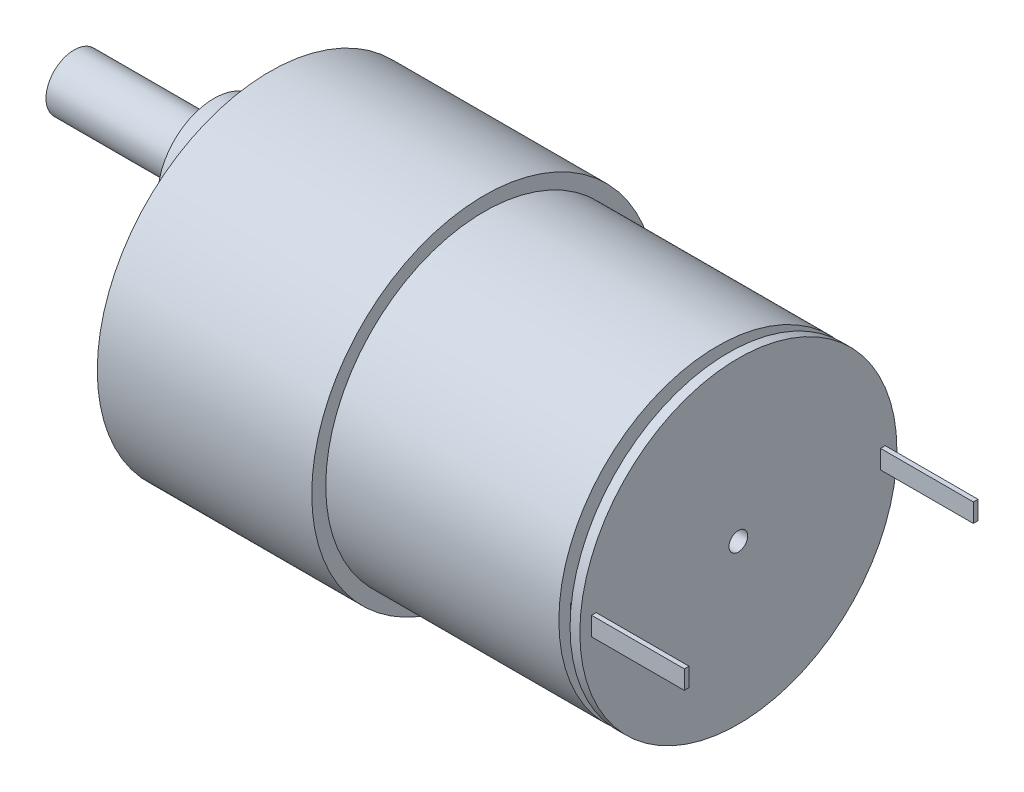
ISO-10303-21;
HEADER;
FILE_DESCRIPTION(('STEP AP214'),'2;1');
FILE_NAME('part.step','',(''),(''),'','','');
FILE_SCHEMA(('AUTOMOTIVE_DESIGN { 1 0 10303 214 1 1 1 1 }'));
ENDSEC;
DATA;
#1=APPLICATION_CONTEXT('core data for automotive mechanical design processes');
#2=APPLICATION_PROTOCOL_DEFINITION('international standard','automotive_design',2000,#1);
#3=PRODUCT_CONTEXT('',#1,'mechanical');
#4=PRODUCT('Part','Part','',(#3));
#5=PRODUCT_RELATED_PRODUCT_CATEGORY('part','',(#4));
#6=PRODUCT_DEFINITION_FORMATION('','',#4);
#7=PRODUCT_DEFINITION_CONTEXT('part definition',#1,'design');
#8=PRODUCT_DEFINITION('design','',#6,#7);
#9=PRODUCT_DEFINITION_SHAPE('','',#8);
#10=(LENGTH_UNIT() NAMED_UNIT(*) SI_UNIT(.MILLI.,.METRE.));
#11=(NAMED_UNIT(*) PLANE_ANGLE_UNIT() SI_UNIT($,.RADIAN.));
#12=(NAMED_UNIT(*) SI_UNIT($,.STERADIAN.) SOLID_ANGLE_UNIT());
#13=UNCERTAINTY_MEASURE_WITH_UNIT(LENGTH_MEASURE(1.E-05),#10,'distance_accuracy_value','');
#14=(GEOMETRIC_REPRESENTATION_CONTEXT(3) GLOBAL_UNCERTAINTY_ASSIGNED_CONTEXT((#13)) GLOBAL_UNIT_ASSIGNED_CONTEXT((#10,
#11,#12)) REPRESENTATION_CONTEXT('',''));
#15=CARTESIAN_POINT('',(0.,0.,0.));
#16=DIRECTION('',(0.,0.,1.));
#17=DIRECTION('',(1.,0.,0.));
#18=AXIS2_PLACEMENT_3D('',#15,#16,#17);
#19=CARTESIAN_POINT('',(40.2,0.,0.));
#20=DIRECTION('',(1.,0.,0.));
#21=DIRECTION('',(0.,0.,-1.));
#22=AXIS2_PLACEMENT_3D('',#19,#20,#21);
#23=CYLINDRICAL_SURFACE('',#22,17.);
#24=CARTESIAN_POINT('',(40.2,0.,0.));
#25=DIRECTION('',(1.,0.,0.));
#26=DIRECTION('',(0.,0.,-1.));
#27=AXIS2_PLACEMENT_3D('',#24,#25,#26);
#28=CIRCLE('',#27,17.);
#29=CARTESIAN_POINT('',(40.2,0.,-17.));
#30=VERTEX_POINT('',#29);
#31=EDGE_CURVE('E342',#30,#30,#28,.T.);
#32=ORIENTED_EDGE('',*,*,#31,.T.);
#33=EDGE_LOOP('',(#32));
#34=FACE_BOUND('',#33,.T.);
#35=CARTESIAN_POINT('',(41.25,0.,0.));
#36=DIRECTION('',(1.,0.,0.));
#37=DIRECTION('',(0.,0.,-1.));
#38=AXIS2_PLACEMENT_3D('',#35,#36,#37);
#39=CIRCLE('',#38,17.);
#40=CARTESIAN_POINT('',(41.25,0.,-17.));
#41=VERTEX_POINT('',#40);
#42=EDGE_CURVE('E341',#41,#41,#39,.T.);
#43=ORIENTED_EDGE('',*,*,#42,.F.);
#44=EDGE_LOOP('',(#43));
#45=FACE_BOUND('',#44,.T.);
#46=ADVANCED_FACE('F33',(#34,#45),#23,.T.);
#47=CARTESIAN_POINT('',(40.2,0.,0.));
#48=DIRECTION('',(1.,0.,0.));
#49=DIRECTION('',(0.,0.,-1.));
#50=AXIS2_PLACEMENT_3D('',#47,#48,#49);
#51=PLANE('',#50);
#52=CARTESIAN_POINT('',(40.2,-2.21813606772281E-13,0.));
#53=DIRECTION('',(1.,0.,0.));
#54=DIRECTION('',(0.,0.,-1.));
#55=AXIS2_PLACEMENT_3D('',#52,#53,#54);
#56=CIRCLE('',#55,1.5);
#57=CARTESIAN_POINT('',(40.2,-2.21813606772281E-13,-1.49999999999998));
#58=VERTEX_POINT('',#57);
#59=EDGE_CURVE('E11',#58,#58,#56,.F.);
#60=ORIENTED_EDGE('',*,*,#59,.F.);
#61=EDGE_LOOP('',(#60));
#62=FACE_BOUND('',#61,.T.);
#63=DIRECTION('',(0.,1.,0.));
#64=VECTOR('',#63,1.);
#65=CARTESIAN_POINT('',(40.2,0.,-15.75));
#66=LINE('',#65,#64);
#67=CARTESIAN_POINT('',(40.2,-0.999999999999999,-15.75));
#68=VERTEX_POINT('',#67);
#69=CARTESIAN_POINT('',(40.2,0.999999999999999,-15.75));
#70=VERTEX_POINT('',#69);
#71=EDGE_CURVE('E265',#68,#70,#66,.T.);
#72=ORIENTED_EDGE('',*,*,#71,.T.);
#73=DIRECTION('',(0.,0.,1.));
#74=VECTOR('',#73,1.);
#75=CARTESIAN_POINT('',(40.2,0.999999999999999,0.));
#76=LINE('',#75,#74);
#77=CARTESIAN_POINT('',(40.2,0.999999999999999,-15.25));
#78=VERTEX_POINT('',#77);
#79=EDGE_CURVE('E286',#70,#78,#76,.T.);
#80=ORIENTED_EDGE('',*,*,#79,.T.);
#81=DIRECTION('',(0.,-1.,0.));
#82=VECTOR('',#81,1.);
#83=CARTESIAN_POINT('',(40.2,0.,-15.25));
#84=LINE('',#83,#82);
#85=CARTESIAN_POINT('',(40.2,-0.999999999999999,-15.25));
#86=VERTEX_POINT('',#85);
#87=EDGE_CURVE('E283',#78,#86,#84,.T.);
#88=ORIENTED_EDGE('',*,*,#87,.T.);
#89=DIRECTION('',(0.,0.,-1.));
#90=VECTOR('',#89,1.);
#91=CARTESIAN_POINT('',(40.2,-0.999999999999999,0.));
#92=LINE('',#91,#90);
#93=EDGE_CURVE('E280',#86,#68,#92,.T.);
#94=ORIENTED_EDGE('',*,*,#93,.T.);
#95=EDGE_LOOP('',(#72,#80,#88,#94));
#96=FACE_BOUND('',#95,.T.);
#97=DIRECTION('',(0.,1.,0.));
#98=VECTOR('',#97,1.);
#99=CARTESIAN_POINT('',(40.2,0.,15.25));
#100=LINE('',#99,#98);
#101=CARTESIAN_POINT('',(40.2,-0.999999999999999,15.25));
#102=VERTEX_POINT('',#101);
#103=CARTESIAN_POINT('',(40.2,0.999999999999999,15.25));
#104=VERTEX_POINT('',#103);
#105=EDGE_CURVE('E317',#102,#104,#100,.T.);
#106=ORIENTED_EDGE('',*,*,#105,.T.);
#107=DIRECTION('',(0.,0.,1.));
#108=VECTOR('',#107,1.);
#109=CARTESIAN_POINT('',(40.2,0.999999999999999,0.));
#110=LINE('',#109,#108);
#111=CARTESIAN_POINT('',(40.2,0.999999999999999,15.75));
#112=VERTEX_POINT('',#111);
#113=EDGE_CURVE('E338',#104,#112,#110,.T.);
#114=ORIENTED_EDGE('',*,*,#113,.T.);
#115=DIRECTION('',(0.,-1.,0.));
#116=VECTOR('',#115,1.);
#117=CARTESIAN_POINT('',(40.2,0.,15.75));
#118=LINE('',#117,#116);
#119=CARTESIAN_POINT('',(40.2,-0.999999999999999,15.75));
#120=VERTEX_POINT('',#119);
#121=EDGE_CURVE('E335',#112,#120,#118,.T.);
#122=ORIENTED_EDGE('',*,*,#121,.T.);
#123=DIRECTION('',(0.,0.,-1.));
#124=VECTOR('',#123,1.);
#125=CARTESIAN_POINT('',(40.2,-0.999999999999999,0.));
#126=LINE('',#125,#124);
#127=EDGE_CURVE('E332',#120,#102,#126,.T.);
#128=ORIENTED_EDGE('',*,*,#127,.T.);
#129=EDGE_LOOP('',(#106,#114,#122,#128));
#130=FACE_BOUND('',#129,.T.);
#131=ORIENTED_EDGE('',*,*,#31,.F.);
#132=EDGE_LOOP('',(#131));
#133=FACE_BOUND('',#132,.T.);
#134=ADVANCED_FACE('F395',(#62,#96,#130,#133),#51,.F.);
#135=CARTESIAN_POINT('',(41.25,0.,0.));
#136=DIRECTION('',(1.,0.,0.));
#137=DIRECTION('',(0.,0.,-1.));
#138=AXIS2_PLACEMENT_3D('',#135,#136,#137);
#139=PLANE('',#138);
#140=CARTESIAN_POINT('',(41.25,-1.46316292415369E-13,0.));
#141=DIRECTION('',(1.,0.,0.));
#142=DIRECTION('',(0.,0.,-1.));
#143=AXIS2_PLACEMENT_3D('',#140,#141,#142);
#144=CIRCLE('',#143,0.999999999999989);
#145=CARTESIAN_POINT('',(41.25,-1.46316292415369E-13,-1.00000000000001));
#146=VERTEX_POINT('',#145);
#147=EDGE_CURVE('E208',#146,#146,#144,.T.);
#148=ORIENTED_EDGE('',*,*,#147,.F.);
#149=EDGE_LOOP('',(#148));
#150=FACE_BOUND('',#149,.T.);
#151=DIRECTION('',(0.,0.,1.));
#152=VECTOR('',#151,1.);
#153=CARTESIAN_POINT('',(41.25,0.999999999999999,0.));
#154=LINE('',#153,#152);
#155=CARTESIAN_POINT('',(41.25,0.999999999999999,-15.75));
#156=VERTEX_POINT('',#155);
#157=CARTESIAN_POINT('',(41.25,0.999999999999999,-15.25));
#158=VERTEX_POINT('',#157);
#159=EDGE_CURVE('E40',#156,#158,#154,.T.);
#160=ORIENTED_EDGE('',*,*,#159,.F.);
#161=DIRECTION('',(0.,1.,0.));
#162=VECTOR('',#161,1.);
#163=CARTESIAN_POINT('',(41.25,0.,-15.75));
#164=LINE('',#163,#162);
#165=CARTESIAN_POINT('',(41.25,-0.999999999999999,-15.75));
#166=VERTEX_POINT('',#165);
#167=EDGE_CURVE('E359',#166,#156,#164,.T.);
#168=ORIENTED_EDGE('',*,*,#167,.F.);
#169=DIRECTION('',(0.,0.,-1.));
#170=VECTOR('',#169,1.);
#171=CARTESIAN_POINT('',(41.25,-0.999999999999999,0.));
#172=LINE('',#171,#170);
#173=CARTESIAN_POINT('',(41.25,-0.999999999999999,-15.25));
#174=VERTEX_POINT('',#173);
#175=EDGE_CURVE('E362',#174,#166,#172,.T.);
#176=ORIENTED_EDGE('',*,*,#175,.F.);
#177=DIRECTION('',(0.,-1.,0.));
#178=VECTOR('',#177,1.);
#179=CARTESIAN_POINT('',(41.25,0.,-15.25));
#180=LINE('',#179,#178);
#181=EDGE_CURVE('E55',#158,#174,#180,.T.);
#182=ORIENTED_EDGE('',*,*,#181,.F.);
#183=EDGE_LOOP('',(#160,#168,#176,#182));
#184=FACE_BOUND('',#183,.T.);
#185=DIRECTION('',(0.,0.,1.));
#186=VECTOR('',#185,1.);
#187=CARTESIAN_POINT('',(41.25,0.999999999999999,0.));
#188=LINE('',#187,#186);
#189=CARTESIAN_POINT('',(41.25,0.999999999999999,15.25));
#190=VERTEX_POINT('',#189);
#191=CARTESIAN_POINT('',(41.25,0.999999999999999,15.75));
#192=VERTEX_POINT('',#191);
#193=EDGE_CURVE('E356',#190,#192,#188,.T.);
#194=ORIENTED_EDGE('',*,*,#193,.F.);
#195=DIRECTION('',(0.,1.,0.));
#196=VECTOR('',#195,1.);
#197=CARTESIAN_POINT('',(41.25,0.,15.25));
#198=LINE('',#197,#196);
#199=CARTESIAN_POINT('',(41.25,-0.999999999999999,15.25));
#200=VERTEX_POINT('',#199);
#201=EDGE_CURVE('E345',#200,#190,#198,.T.);
#202=ORIENTED_EDGE('',*,*,#201,.F.);
#203=DIRECTION('',(0.,0.,-1.));
#204=VECTOR('',#203,1.);
#205=CARTESIAN_POINT('',(41.25,-0.999999999999999,0.));
#206=LINE('',#205,#204);
#207=CARTESIAN_POINT('',(41.25,-0.999999999999999,15.75));
#208=VERTEX_POINT('',#207);
#209=EDGE_CURVE('E350',#208,#200,#206,.T.);
#210=ORIENTED_EDGE('',*,*,#209,.F.);
#211=DIRECTION('',(0.,-1.,0.));
#212=VECTOR('',#211,1.);
#213=CARTESIAN_POINT('',(41.25,0.,15.75));
#214=LINE('',#213,#212);
#215=EDGE_CURVE('E353',#192,#208,#214,.T.);
#216=ORIENTED_EDGE('',*,*,#215,.F.);
#217=EDGE_LOOP('',(#194,#202,#210,#216));
#218=FACE_BOUND('',#217,.T.);
#219=ORIENTED_EDGE('',*,*,#42,.T.);
#220=EDGE_LOOP('',(#219));
#221=FACE_BOUND('',#220,.T.);
#222=ADVANCED_FACE('F377',(#150,#184,#218,#221),#139,.T.);
#223=CARTESIAN_POINT('',(51.2,0.,0.));
#224=DIRECTION('',(1.,0.,0.));
#225=DIRECTION('',(0.,0.,-1.));
#226=AXIS2_PLACEMENT_3D('',#223,#224,#225);
#227=PLANE('',#226);
#228=DIRECTION('',(0.,0.,-1.));
#229=VECTOR('',#228,1.);
#230=CARTESIAN_POINT('',(51.2,0.999999999999999,15.25));
#231=LINE('',#230,#229);
#232=CARTESIAN_POINT('',(51.2,0.999999999999999,15.75));
#233=VERTEX_POINT('',#232);
#234=CARTESIAN_POINT('',(51.2,0.999999999999999,15.25));
#235=VERTEX_POINT('',#234);
#236=EDGE_CURVE('E301',#233,#235,#231,.T.);
#237=ORIENTED_EDGE('',*,*,#236,.F.);
#238=DIRECTION('',(0.,1.,0.));
#239=VECTOR('',#238,1.);
#240=CARTESIAN_POINT('',(51.2,0.999999999999999,15.75));
#241=LINE('',#240,#239);
#242=CARTESIAN_POINT('',(51.2,-0.999999999999999,15.75));
#243=VERTEX_POINT('',#242);
#244=EDGE_CURVE('E310',#243,#233,#241,.T.);
#245=ORIENTED_EDGE('',*,*,#244,.F.);
#246=DIRECTION('',(0.,0.,1.));
#247=VECTOR('',#246,1.);
#248=CARTESIAN_POINT('',(51.2,-0.999999999999999,15.75));
#249=LINE('',#248,#247);
#250=CARTESIAN_POINT('',(51.2,-0.999999999999999,15.25));
#251=VERTEX_POINT('',#250);
#252=EDGE_CURVE('E307',#251,#243,#249,.T.);
#253=ORIENTED_EDGE('',*,*,#252,.F.);
#254=DIRECTION('',(0.,-1.,0.));
#255=VECTOR('',#254,1.);
#256=CARTESIAN_POINT('',(51.2,-0.999999999999999,15.25));
#257=LINE('',#256,#255);
#258=EDGE_CURVE('E304',#235,#251,#257,.T.);
#259=ORIENTED_EDGE('',*,*,#258,.F.);
#260=EDGE_LOOP('',(#237,#245,#253,#259));
#261=FACE_BOUND('',#260,.T.);
#262=ADVANCED_FACE('F407',(#261),#227,.T.);
#263=CARTESIAN_POINT('',(51.2,-0.999999999999999,15.25));
#264=DIRECTION('',(0.,0.,-1.));
#265=DIRECTION('',(-1.,0.,0.));
#266=AXIS2_PLACEMENT_3D('',#263,#264,#265);
#267=PLANE('',#266);
#268=DIRECTION('',(-1.,0.,0.));
#269=VECTOR('',#268,1.);
#270=CARTESIAN_POINT('',(51.2,-0.999999999999999,15.25));
#271=LINE('',#270,#269);
#272=EDGE_CURVE('E323',#251,#200,#271,.T.);
#273=ORIENTED_EDGE('',*,*,#272,.T.);
#274=ORIENTED_EDGE('',*,*,#201,.T.);
#275=DIRECTION('',(-1.,0.,0.));
#276=VECTOR('',#275,1.);
#277=CARTESIAN_POINT('',(51.2,0.999999999999999,15.25));
#278=LINE('',#277,#276);
#279=EDGE_CURVE('E327',#235,#190,#278,.T.);
#280=ORIENTED_EDGE('',*,*,#279,.F.);
#281=ORIENTED_EDGE('',*,*,#258,.T.);
#282=EDGE_LOOP('',(#273,#274,#280,#281));
#283=FACE_BOUND('',#282,.T.);
#284=ADVANCED_FACE('F412',(#283),#267,.T.);
#285=CARTESIAN_POINT('',(51.2,-0.999999999999999,15.75));
#286=DIRECTION('',(0.,-1.,0.));
#287=DIRECTION('',(0.,0.,-1.));
#288=AXIS2_PLACEMENT_3D('',#285,#286,#287);
#289=PLANE('',#288);
#290=DIRECTION('',(-1.,0.,0.));
#291=VECTOR('',#290,1.);
#292=CARTESIAN_POINT('',(51.2,-0.999999999999999,15.75));
#293=LINE('',#292,#291);
#294=EDGE_CURVE('E319',#243,#208,#293,.T.);
#295=ORIENTED_EDGE('',*,*,#294,.T.);
#296=ORIENTED_EDGE('',*,*,#209,.T.);
#297=ORIENTED_EDGE('',*,*,#272,.F.);
#298=ORIENTED_EDGE('',*,*,#252,.T.);
#299=EDGE_LOOP('',(#295,#296,#297,#298));
#300=FACE_BOUND('',#299,.T.);
#301=ADVANCED_FACE('F425',(#300),#289,.T.);
#302=CARTESIAN_POINT('',(51.2,0.999999999999999,15.75));
#303=DIRECTION('',(0.,0.,1.));
#304=DIRECTION('',(1.,0.,0.));
#305=AXIS2_PLACEMENT_3D('',#302,#303,#304);
#306=PLANE('',#305);
#307=DIRECTION('',(-1.,0.,0.));
#308=VECTOR('',#307,1.);
#309=CARTESIAN_POINT('',(51.2,0.999999999999999,15.75));
#310=LINE('',#309,#308);
#311=EDGE_CURVE('E314',#233,#192,#310,.T.);
#312=ORIENTED_EDGE('',*,*,#311,.T.);
#313=ORIENTED_EDGE('',*,*,#215,.T.);
#314=ORIENTED_EDGE('',*,*,#294,.F.);
#315=ORIENTED_EDGE('',*,*,#244,.T.);
#316=EDGE_LOOP('',(#312,#313,#314,#315));
#317=FACE_BOUND('',#316,.T.);
#318=ADVANCED_FACE('F421',(#317),#306,.T.);
#319=CARTESIAN_POINT('',(51.2,0.999999999999999,15.25));
#320=DIRECTION('',(0.,1.,0.));
#321=DIRECTION('',(0.,0.,1.));
#322=AXIS2_PLACEMENT_3D('',#319,#320,#321);
#323=PLANE('',#322);
#324=ORIENTED_EDGE('',*,*,#279,.T.);
#325=ORIENTED_EDGE('',*,*,#193,.T.);
#326=ORIENTED_EDGE('',*,*,#311,.F.);
#327=ORIENTED_EDGE('',*,*,#236,.T.);
#328=EDGE_LOOP('',(#324,#325,#326,#327));
#329=FACE_BOUND('',#328,.T.);
#330=ADVANCED_FACE('F417',(#329),#323,.T.);
#331=ORIENTED_EDGE('',*,*,#113,.F.);
#332=CARTESIAN_POINT('',(39.,0.999999999999999,15.25));
#333=VERTEX_POINT('',#332);
#334=EDGE_CURVE('E313',#104,#333,#278,.T.);
#335=ORIENTED_EDGE('',*,*,#334,.T.);
#336=DIRECTION('',(0.,0.,-1.));
#337=VECTOR('',#336,1.);
#338=CARTESIAN_POINT('',(39.,0.999999999999999,15.25));
#339=LINE('',#338,#337);
#340=CARTESIAN_POINT('',(39.,0.999999999999999,15.75));
#341=VERTEX_POINT('',#340);
#342=EDGE_CURVE('E289',#341,#333,#339,.T.);
#343=ORIENTED_EDGE('',*,*,#342,.F.);
#344=EDGE_CURVE('E318',#112,#341,#310,.T.);
#345=ORIENTED_EDGE('',*,*,#344,.F.);
#346=EDGE_LOOP('',(#331,#335,#343,#345));
#347=FACE_BOUND('',#346,.T.);
#348=ADVANCED_FACE('F420',(#347),#323,.T.);
#349=ORIENTED_EDGE('',*,*,#121,.F.);
#350=ORIENTED_EDGE('',*,*,#344,.T.);
#351=DIRECTION('',(0.,1.,0.));
#352=VECTOR('',#351,1.);
#353=CARTESIAN_POINT('',(39.,0.999999999999999,15.75));
#354=LINE('',#353,#352);
#355=CARTESIAN_POINT('',(39.,-0.999999999999999,15.75));
#356=VERTEX_POINT('',#355);
#357=EDGE_CURVE('E298',#356,#341,#354,.T.);
#358=ORIENTED_EDGE('',*,*,#357,.F.);
#359=EDGE_CURVE('E322',#120,#356,#293,.T.);
#360=ORIENTED_EDGE('',*,*,#359,.F.);
#361=EDGE_LOOP('',(#349,#350,#358,#360));
#362=FACE_BOUND('',#361,.T.);
#363=ADVANCED_FACE('F434',(#362),#306,.T.);
#364=ORIENTED_EDGE('',*,*,#127,.F.);
#365=ORIENTED_EDGE('',*,*,#359,.T.);
#366=DIRECTION('',(0.,0.,1.));
#367=VECTOR('',#366,1.);
#368=CARTESIAN_POINT('',(39.,-0.999999999999999,15.75));
#369=LINE('',#368,#367);
#370=CARTESIAN_POINT('',(39.,-0.999999999999999,15.25));
#371=VERTEX_POINT('',#370);
#372=EDGE_CURVE('E295',#371,#356,#369,.T.);
#373=ORIENTED_EDGE('',*,*,#372,.F.);
#374=EDGE_CURVE('E326',#102,#371,#271,.T.);
#375=ORIENTED_EDGE('',*,*,#374,.F.);
#376=EDGE_LOOP('',(#364,#365,#373,#375));
#377=FACE_BOUND('',#376,.T.);
#378=ADVANCED_FACE('F431',(#377),#289,.T.);
#379=ORIENTED_EDGE('',*,*,#105,.F.);
#380=ORIENTED_EDGE('',*,*,#374,.T.);
#381=DIRECTION('',(0.,-1.,0.));
#382=VECTOR('',#381,1.);
#383=CARTESIAN_POINT('',(39.,-0.999999999999999,15.25));
#384=LINE('',#383,#382);
#385=EDGE_CURVE('E292',#333,#371,#384,.T.);
#386=ORIENTED_EDGE('',*,*,#385,.F.);
#387=ORIENTED_EDGE('',*,*,#334,.F.);
#388=EDGE_LOOP('',(#379,#380,#386,#387));
#389=FACE_BOUND('',#388,.T.);
#390=ADVANCED_FACE('F427',(#389),#267,.T.);
#391=CARTESIAN_POINT('',(51.2,0.,0.));
#392=DIRECTION('',(1.,0.,0.));
#393=DIRECTION('',(0.,0.,-1.));
#394=AXIS2_PLACEMENT_3D('',#391,#392,#393);
#395=PLANE('',#394);
#396=DIRECTION('',(0.,0.,-1.));
#397=VECTOR('',#396,1.);
#398=CARTESIAN_POINT('',(51.2,0.999999999999999,-15.75));
#399=LINE('',#398,#397);
#400=CARTESIAN_POINT('',(51.2,0.999999999999999,-15.25));
#401=VERTEX_POINT('',#400);
#402=CARTESIAN_POINT('',(51.2,0.999999999999999,-15.75));
#403=VERTEX_POINT('',#402);
#404=EDGE_CURVE('E250',#401,#403,#399,.T.);
#405=ORIENTED_EDGE('',*,*,#404,.F.);
#406=DIRECTION('',(0.,1.,0.));
#407=VECTOR('',#406,1.);
#408=CARTESIAN_POINT('',(51.2,0.999999999999999,-15.25));
#409=LINE('',#408,#407);
#410=CARTESIAN_POINT('',(51.2,-0.999999999999999,-15.25));
#411=VERTEX_POINT('',#410);
#412=EDGE_CURVE('E259',#411,#401,#409,.T.);
#413=ORIENTED_EDGE('',*,*,#412,.F.);
#414=DIRECTION('',(0.,0.,1.));
#415=VECTOR('',#414,1.);
#416=CARTESIAN_POINT('',(51.2,-0.999999999999999,-15.25));
#417=LINE('',#416,#415);
#418=CARTESIAN_POINT('',(51.2,-0.999999999999999,-15.75));
#419=VERTEX_POINT('',#418);
#420=EDGE_CURVE('E256',#419,#411,#417,.T.);
#421=ORIENTED_EDGE('',*,*,#420,.F.);
#422=DIRECTION('',(0.,-1.,0.));
#423=VECTOR('',#422,1.);
#424=CARTESIAN_POINT('',(51.2,-0.999999999999999,-15.75));
#425=LINE('',#424,#423);
#426=EDGE_CURVE('E253',#403,#419,#425,.T.);
#427=ORIENTED_EDGE('',*,*,#426,.F.);
#428=EDGE_LOOP('',(#405,#413,#421,#427));
#429=FACE_BOUND('',#428,.T.);
#430=ADVANCED_FACE('F373',(#429),#395,.T.);
#431=CARTESIAN_POINT('',(51.2,-0.999999999999999,-15.75));
#432=DIRECTION('',(0.,0.,-1.));
#433=DIRECTION('',(-1.,0.,0.));
#434=AXIS2_PLACEMENT_3D('',#431,#432,#433);
#435=PLANE('',#434);
#436=DIRECTION('',(-1.,0.,0.));
#437=VECTOR('',#436,1.);
#438=CARTESIAN_POINT('',(51.2,-0.999999999999999,-15.75));
#439=LINE('',#438,#437);
#440=EDGE_CURVE('E271',#419,#166,#439,.T.);
#441=ORIENTED_EDGE('',*,*,#440,.T.);
#442=ORIENTED_EDGE('',*,*,#167,.T.);
#443=DIRECTION('',(-1.,0.,0.));
#444=VECTOR('',#443,1.);
#445=CARTESIAN_POINT('',(51.2,0.999999999999999,-15.75));
#446=LINE('',#445,#444);
#447=EDGE_CURVE('E275',#403,#156,#446,.T.);
#448=ORIENTED_EDGE('',*,*,#447,.F.);
#449=ORIENTED_EDGE('',*,*,#426,.T.);
#450=EDGE_LOOP('',(#441,#442,#448,#449));
#451=FACE_BOUND('',#450,.T.);
#452=ADVANCED_FACE('F376',(#451),#435,.T.);
#453=CARTESIAN_POINT('',(51.2,-0.999999999999999,-15.25));
#454=DIRECTION('',(0.,-1.,0.));
#455=DIRECTION('',(0.,0.,-1.));
#456=AXIS2_PLACEMENT_3D('',#453,#454,#455);
#457=PLANE('',#456);
#458=DIRECTION('',(-1.,0.,0.));
#459=VECTOR('',#458,1.);
#460=CARTESIAN_POINT('',(51.2,-0.999999999999999,-15.25));
#461=LINE('',#460,#459);
#462=EDGE_CURVE('E267',#411,#174,#461,.T.);
#463=ORIENTED_EDGE('',*,*,#462,.T.);
#464=ORIENTED_EDGE('',*,*,#175,.T.);
#465=ORIENTED_EDGE('',*,*,#440,.F.);
#466=ORIENTED_EDGE('',*,*,#420,.T.);
#467=EDGE_LOOP('',(#463,#464,#465,#466));
#468=FACE_BOUND('',#467,.T.);
#469=ADVANCED_FACE('F380',(#468),#457,.T.);
#470=CARTESIAN_POINT('',(51.2,0.999999999999999,-15.25));
#471=DIRECTION('',(0.,0.,1.));
#472=DIRECTION('',(1.,0.,0.));
#473=AXIS2_PLACEMENT_3D('',#470,#471,#472);
#474=PLANE('',#473);
#475=DIRECTION('',(-1.,0.,0.));
#476=VECTOR('',#475,1.);
#477=CARTESIAN_POINT('',(51.2,0.999999999999999,-15.25));
#478=LINE('',#477,#476);
#479=EDGE_CURVE('E262',#401,#158,#478,.T.);
#480=ORIENTED_EDGE('',*,*,#479,.T.);
#481=ORIENTED_EDGE('',*,*,#181,.T.);
#482=ORIENTED_EDGE('',*,*,#462,.F.);
#483=ORIENTED_EDGE('',*,*,#412,.T.);
#484=EDGE_LOOP('',(#480,#481,#482,#483));
#485=FACE_BOUND('',#484,.T.);
#486=ADVANCED_FACE('F369',(#485),#474,.T.);
#487=CARTESIAN_POINT('',(51.2,0.999999999999999,-15.75));
#488=DIRECTION('',(0.,1.,0.));
#489=DIRECTION('',(0.,0.,1.));
#490=AXIS2_PLACEMENT_3D('',#487,#488,#489);
#491=PLANE('',#490);
#492=ORIENTED_EDGE('',*,*,#447,.T.);
#493=ORIENTED_EDGE('',*,*,#159,.T.);
#494=ORIENTED_EDGE('',*,*,#479,.F.);
#495=ORIENTED_EDGE('',*,*,#404,.T.);
#496=EDGE_LOOP('',(#492,#493,#494,#495));
#497=FACE_BOUND('',#496,.T.);
#498=ADVANCED_FACE('F366',(#497),#491,.T.);
#499=ORIENTED_EDGE('',*,*,#79,.F.);
#500=CARTESIAN_POINT('',(39.,0.999999999999999,-15.75));
#501=VERTEX_POINT('',#500);
#502=EDGE_CURVE('E47',#70,#501,#446,.T.);
#503=ORIENTED_EDGE('',*,*,#502,.T.);
#504=DIRECTION('',(0.,0.,-1.));
#505=VECTOR('',#504,1.);
#506=CARTESIAN_POINT('',(39.,0.999999999999999,-15.75));
#507=LINE('',#506,#505);
#508=CARTESIAN_POINT('',(39.,0.999999999999999,-15.25));
#509=VERTEX_POINT('',#508);
#510=EDGE_CURVE('E238',#509,#501,#507,.T.);
#511=ORIENTED_EDGE('',*,*,#510,.F.);
#512=EDGE_CURVE('E266',#78,#509,#478,.T.);
#513=ORIENTED_EDGE('',*,*,#512,.F.);
#514=EDGE_LOOP('',(#499,#503,#511,#513));
#515=FACE_BOUND('',#514,.T.);
#516=ADVANCED_FACE('F437',(#515),#491,.T.);
#517=ORIENTED_EDGE('',*,*,#87,.F.);
#518=ORIENTED_EDGE('',*,*,#512,.T.);
#519=DIRECTION('',(0.,1.,0.));
#520=VECTOR('',#519,1.);
#521=CARTESIAN_POINT('',(39.,0.999999999999999,-15.25));
#522=LINE('',#521,#520);
#523=CARTESIAN_POINT('',(39.,-0.999999999999999,-15.25));
#524=VERTEX_POINT('',#523);
#525=EDGE_CURVE('E247',#524,#509,#522,.T.);
#526=ORIENTED_EDGE('',*,*,#525,.F.);
#527=EDGE_CURVE('E270',#86,#524,#461,.T.);
#528=ORIENTED_EDGE('',*,*,#527,.F.);
#529=EDGE_LOOP('',(#517,#518,#526,#528));
#530=FACE_BOUND('',#529,.T.);
#531=ADVANCED_FACE('F389',(#530),#474,.T.);
#532=ORIENTED_EDGE('',*,*,#93,.F.);
#533=ORIENTED_EDGE('',*,*,#527,.T.);
#534=DIRECTION('',(0.,0.,1.));
#535=VECTOR('',#534,1.);
#536=CARTESIAN_POINT('',(39.,-0.999999999999999,-15.25));
#537=LINE('',#536,#535);
#538=CARTESIAN_POINT('',(39.,-0.999999999999999,-15.75));
#539=VERTEX_POINT('',#538);
#540=EDGE_CURVE('E244',#539,#524,#537,.T.);
#541=ORIENTED_EDGE('',*,*,#540,.F.);
#542=EDGE_CURVE('E274',#68,#539,#439,.T.);
#543=ORIENTED_EDGE('',*,*,#542,.F.);
#544=EDGE_LOOP('',(#532,#533,#541,#543));
#545=FACE_BOUND('',#544,.T.);
#546=ADVANCED_FACE('F383',(#545),#457,.T.);
#547=ORIENTED_EDGE('',*,*,#71,.F.);
#548=ORIENTED_EDGE('',*,*,#542,.T.);
#549=DIRECTION('',(0.,-1.,0.));
#550=VECTOR('',#549,1.);
#551=CARTESIAN_POINT('',(39.,-0.999999999999999,-15.75));
#552=LINE('',#551,#550);
#553=EDGE_CURVE('E241',#501,#539,#552,.T.);
#554=ORIENTED_EDGE('',*,*,#553,.F.);
#555=ORIENTED_EDGE('',*,*,#502,.F.);
#556=EDGE_LOOP('',(#547,#548,#554,#555));
#557=FACE_BOUND('',#556,.T.);
#558=ADVANCED_FACE('F391',(#557),#435,.T.);
#559=CARTESIAN_POINT('',(39.,-2.21813606772281E-13,0.));
#560=DIRECTION('',(1.,0.,0.));
#561=DIRECTION('',(0.,0.,-1.));
#562=AXIS2_PLACEMENT_3D('',#559,#560,#561);
#563=CYLINDRICAL_SURFACE('',#562,1.5);
#564=CARTESIAN_POINT('',(39.,-2.21813606772281E-13,0.));
#565=DIRECTION('',(-1.,0.,0.));
#566=DIRECTION('',(0.,0.,1.));
#567=AXIS2_PLACEMENT_3D('',#564,#565,#566);
#568=CIRCLE('',#567,1.5);
#569=CARTESIAN_POINT('',(39.,-2.21813606772281E-13,1.50000000000002));
#570=VERTEX_POINT('',#569);
#571=EDGE_CURVE('E235',#570,#570,#568,.T.);
#572=ORIENTED_EDGE('',*,*,#571,.F.);
#573=EDGE_LOOP('',(#572));
#574=FACE_BOUND('',#573,.T.);
#575=ORIENTED_EDGE('',*,*,#59,.T.);
#576=EDGE_LOOP('',(#575));
#577=FACE_BOUND('',#576,.T.);
#578=ADVANCED_FACE('F467',(#574,#577),#563,.T.);
#579=CARTESIAN_POINT('',(14.,0.,0.));
#580=DIRECTION('',(1.,0.,0.));
#581=DIRECTION('',(0.,0.,-1.));
#582=AXIS2_PLACEMENT_3D('',#579,#580,#581);
#583=CYLINDRICAL_SURFACE('',#582,17.);
#584=CARTESIAN_POINT('',(14.,0.,0.));
#585=DIRECTION('',(1.,0.,0.));
#586=DIRECTION('',(0.,0.,-1.));
#587=AXIS2_PLACEMENT_3D('',#584,#585,#586);
#588=CIRCLE('',#587,17.);
#589=CARTESIAN_POINT('',(14.,0.,-17.));
#590=VERTEX_POINT('',#589);
#591=EDGE_CURVE('E229',#590,#590,#588,.T.);
#592=ORIENTED_EDGE('',*,*,#591,.T.);
#593=EDGE_LOOP('',(#592));
#594=FACE_BOUND('',#593,.T.);
#595=CARTESIAN_POINT('',(39.,0.,0.));
#596=DIRECTION('',(1.,0.,0.));
#597=DIRECTION('',(0.,0.,-1.));
#598=AXIS2_PLACEMENT_3D('',#595,#596,#597);
#599=CIRCLE('',#598,17.);
#600=CARTESIAN_POINT('',(39.,0.,-17.));
#601=VERTEX_POINT('',#600);
#602=EDGE_CURVE('E232',#601,#601,#599,.T.);
#603=ORIENTED_EDGE('',*,*,#602,.F.);
#604=EDGE_LOOP('',(#603));
#605=FACE_BOUND('',#604,.T.);
#606=ADVANCED_FACE('F459',(#594,#605),#583,.T.);
#607=CARTESIAN_POINT('',(39.,0.,0.));
#608=DIRECTION('',(1.,0.,0.));
#609=DIRECTION('',(0.,0.,-1.));
#610=AXIS2_PLACEMENT_3D('',#607,#608,#609);
#611=PLANE('',#610);
#612=ORIENTED_EDGE('',*,*,#357,.T.);
#613=ORIENTED_EDGE('',*,*,#342,.T.);
#614=ORIENTED_EDGE('',*,*,#385,.T.);
#615=ORIENTED_EDGE('',*,*,#372,.T.);
#616=EDGE_LOOP('',(#612,#613,#614,#615));
#617=FACE_BOUND('',#616,.T.);
#618=ORIENTED_EDGE('',*,*,#525,.T.);
#619=ORIENTED_EDGE('',*,*,#510,.T.);
#620=ORIENTED_EDGE('',*,*,#553,.T.);
#621=ORIENTED_EDGE('',*,*,#540,.T.);
#622=EDGE_LOOP('',(#618,#619,#620,#621));
#623=FACE_BOUND('',#622,.T.);
#624=ORIENTED_EDGE('',*,*,#571,.T.);
#625=EDGE_LOOP('',(#624));
#626=FACE_BOUND('',#625,.T.);
#627=ORIENTED_EDGE('',*,*,#602,.T.);
#628=EDGE_LOOP('',(#627));
#629=FACE_BOUND('',#628,.T.);
#630=ADVANCED_FACE('F455',(#617,#623,#626,#629),#611,.T.);
#631=CARTESIAN_POINT('',(-7.50000000000003,0.,0.));
#632=DIRECTION('',(1.,0.,0.));
#633=DIRECTION('',(0.,0.,-1.));
#634=AXIS2_PLACEMENT_3D('',#631,#632,#633);
#635=CYLINDRICAL_SURFACE('',#634,18.5);
#636=CARTESIAN_POINT('',(14.,0.,0.));
#637=DIRECTION('',(1.,0.,0.));
#638=DIRECTION('',(0.,0.,1.));
#639=AXIS2_PLACEMENT_3D('',#636,#637,#638);
#640=CIRCLE('',#639,18.5);
#641=CARTESIAN_POINT('',(14.,0.,18.5));
#642=VERTEX_POINT('',#641);
#643=EDGE_CURVE('E226',#642,#642,#640,.T.);
#644=ORIENTED_EDGE('',*,*,#643,.F.);
#645=EDGE_LOOP('',(#644));
#646=FACE_BOUND('',#645,.T.);
#647=CARTESIAN_POINT('',(-9.00000000000003,0.,0.));
#648=DIRECTION('',(-1.,0.,0.));
#649=DIRECTION('',(0.,0.,1.));
#650=AXIS2_PLACEMENT_3D('',#647,#648,#649);
#651=CIRCLE('',#650,18.5);
#652=CARTESIAN_POINT('',(-9.00000000000003,0.,18.5));
#653=VERTEX_POINT('',#652);
#654=EDGE_CURVE('E221',#653,#653,#651,.T.);
#655=ORIENTED_EDGE('',*,*,#654,.F.);
#656=EDGE_LOOP('',(#655));
#657=FACE_BOUND('',#656,.T.);
#658=ADVANCED_FACE('F458',(#646,#657),#635,.T.);
#659=CARTESIAN_POINT('',(14.,0.,0.));
#660=DIRECTION('',(-1.,0.,0.));
#661=DIRECTION('',(0.,0.,1.));
#662=AXIS2_PLACEMENT_3D('',#659,#660,#661);
#663=PLANE('',#662);
#664=ORIENTED_EDGE('',*,*,#591,.F.);
#665=EDGE_LOOP('',(#664));
#666=FACE_BOUND('',#665,.T.);
#667=ORIENTED_EDGE('',*,*,#643,.T.);
#668=EDGE_LOOP('',(#667));
#669=FACE_BOUND('',#668,.T.);
#670=ADVANCED_FACE('F554',(#666,#669),#663,.F.);
#671=CARTESIAN_POINT('',(-9.00000000000003,0.,0.));
#672=DIRECTION('',(-1.,0.,0.));
#673=DIRECTION('',(0.,0.,1.));
#674=AXIS2_PLACEMENT_3D('',#671,#672,#673);
#675=PLANE('',#674);
#676=CARTESIAN_POINT('',(-9.00000000000004,0.,-15.5));
#677=DIRECTION('',(-1.,0.,0.));
#678=DIRECTION('',(0.,0.,1.));
#679=AXIS2_PLACEMENT_3D('',#676,#677,#678);
#680=CIRCLE('',#679,1.49999999999999);
#681=CARTESIAN_POINT('',(-9.00000000000004,0.,-14.));
#682=VERTEX_POINT('',#681);
#683=EDGE_CURVE('E172',#682,#682,#680,.T.);
#684=ORIENTED_EDGE('',*,*,#683,.F.);
#685=EDGE_LOOP('',(#684));
#686=FACE_BOUND('',#685,.T.);
#687=CARTESIAN_POINT('',(-9.00000000000004,13.4233937586588,-7.75));
#688=DIRECTION('',(-1.,0.,0.));
#689=DIRECTION('',(0.,0.,1.));
#690=AXIS2_PLACEMENT_3D('',#687,#688,#689);
#691=CIRCLE('',#690,1.49999999999999);
#692=CARTESIAN_POINT('',(-9.00000000000004,13.4233937586588,-6.25000000000001));
#693=VERTEX_POINT('',#692);
#694=EDGE_CURVE('E171',#693,#693,#691,.T.);
#695=ORIENTED_EDGE('',*,*,#694,.F.);
#696=EDGE_LOOP('',(#695));
#697=FACE_BOUND('',#696,.T.);
#698=CARTESIAN_POINT('',(-9.00000000000004,13.2728586947431,8.0050747697559));
#699=DIRECTION('',(-1.,0.,0.));
#700=DIRECTION('',(0.,0.,1.));
#701=AXIS2_PLACEMENT_3D('',#698,#699,#700);
#702=CIRCLE('',#701,1.49999999999999);
#703=CARTESIAN_POINT('',(-9.00000000000004,13.2728586947431,9.50507476975589));
#704=VERTEX_POINT('',#703);
#705=EDGE_CURVE('E184',#704,#704,#702,.T.);
#706=ORIENTED_EDGE('',*,*,#705,.F.);
#707=EDGE_LOOP('',(#706));
#708=FACE_BOUND('',#707,.T.);
#709=CARTESIAN_POINT('',(-9.00000000000004,0.,15.5));
#710=DIRECTION('',(-1.,0.,0.));
#711=DIRECTION('',(0.,0.,1.));
#712=AXIS2_PLACEMENT_3D('',#709,#710,#711);
#713=CIRCLE('',#712,1.49999999999999);
#714=CARTESIAN_POINT('',(-9.00000000000004,0.,17.));
#715=VERTEX_POINT('',#714);
#716=EDGE_CURVE('E190',#715,#715,#713,.T.);
#717=ORIENTED_EDGE('',*,*,#716,.F.);
#718=EDGE_LOOP('',(#717));
#719=FACE_BOUND('',#718,.T.);
#720=CARTESIAN_POINT('',(-9.00000000000004,-13.4233937586589,7.74999999999987));
#721=DIRECTION('',(-1.,0.,0.));
#722=DIRECTION('',(0.,0.,1.));
#723=AXIS2_PLACEMENT_3D('',#720,#721,#722);
#724=CIRCLE('',#723,1.49999999999999);
#725=CARTESIAN_POINT('',(-9.00000000000004,-13.4233937586589,9.24999999999986));
#726=VERTEX_POINT('',#725);
#727=EDGE_CURVE('E196',#726,#726,#724,.T.);
#728=ORIENTED_EDGE('',*,*,#727,.F.);
#729=EDGE_LOOP('',(#728));
#730=FACE_BOUND('',#729,.T.);
#731=CARTESIAN_POINT('',(-9.00000000000004,-13.4233937586588,-7.75));
#732=DIRECTION('',(-1.,0.,0.));
#733=DIRECTION('',(0.,0.,1.));
#734=AXIS2_PLACEMENT_3D('',#731,#732,#733);
#735=CIRCLE('',#734,1.49999999999999);
#736=CARTESIAN_POINT('',(-9.00000000000004,-13.4233937586588,-6.25000000000001));
#737=VERTEX_POINT('',#736);
#738=EDGE_CURVE('E202',#737,#737,#735,.T.);
#739=ORIENTED_EDGE('',*,*,#738,.F.);
#740=EDGE_LOOP('',(#739));
#741=FACE_BOUND('',#740,.T.);
#742=CARTESIAN_POINT('',(-9.00000000000003,7.,0.));
#743=DIRECTION('',(-1.,0.,0.));
#744=DIRECTION('',(0.,0.,1.));
#745=AXIS2_PLACEMENT_3D('',#742,#743,#744);
#746=CIRCLE('',#745,6.);
#747=CARTESIAN_POINT('',(-9.00000000000003,7.,6.));
#748=VERTEX_POINT('',#747);
#749=EDGE_CURVE('E217',#748,#748,#746,.T.);
#750=ORIENTED_EDGE('',*,*,#749,.F.);
#751=EDGE_LOOP('',(#750));
#752=FACE_BOUND('',#751,.T.);
#753=ORIENTED_EDGE('',*,*,#654,.T.);
#754=EDGE_LOOP('',(#753));
#755=FACE_BOUND('',#754,.T.);
#756=ADVANCED_FACE('F559',(#686,#697,#708,#719,#730,#741,#752,#755),#675,.T.);
#757=CARTESIAN_POINT('',(-15.,7.,0.));
#758=DIRECTION('',(1.,0.,0.));
#759=DIRECTION('',(0.,0.,-1.));
#760=AXIS2_PLACEMENT_3D('',#757,#758,#759);
#761=CYLINDRICAL_SURFACE('',#760,6.);
#762=CARTESIAN_POINT('',(-15.,7.,0.));
#763=DIRECTION('',(-1.,0.,0.));
#764=DIRECTION('',(0.,0.,1.));
#765=AXIS2_PLACEMENT_3D('',#762,#763,#764);
#766=CIRCLE('',#765,6.);
#767=CARTESIAN_POINT('',(-15.,7.,6.));
#768=VERTEX_POINT('',#767);
#769=EDGE_CURVE('E218',#768,#768,#766,.T.);
#770=ORIENTED_EDGE('',*,*,#769,.F.);
#771=EDGE_LOOP('',(#770));
#772=FACE_BOUND('',#771,.T.);
#773=ORIENTED_EDGE('',*,*,#749,.T.);
#774=EDGE_LOOP('',(#773));
#775=FACE_BOUND('',#774,.T.);
#776=ADVANCED_FACE('F574',(#772,#775),#761,.T.);
#777=CARTESIAN_POINT('',(-15.,7.,0.));
#778=DIRECTION('',(-1.,0.,0.));
#779=DIRECTION('',(0.,0.,1.));
#780=AXIS2_PLACEMENT_3D('',#777,#778,#779);
#781=PLANE('',#780);
#782=CARTESIAN_POINT('',(-15.,7.,0.));
#783=DIRECTION('',(-1.,0.,0.));
#784=DIRECTION('',(0.,0.,1.));
#785=AXIS2_PLACEMENT_3D('',#782,#783,#784);
#786=CIRCLE('',#785,3.);
#787=CARTESIAN_POINT('',(-15.,7.,3.));
#788=VERTEX_POINT('',#787);
#789=EDGE_CURVE('E214',#788,#788,#786,.T.);
#790=ORIENTED_EDGE('',*,*,#789,.F.);
#791=EDGE_LOOP('',(#790));
#792=FACE_BOUND('',#791,.T.);
#793=ORIENTED_EDGE('',*,*,#769,.T.);
#794=EDGE_LOOP('',(#793));
#795=FACE_BOUND('',#794,.T.);
#796=ADVANCED_FACE('F579',(#792,#795),#781,.T.);
#797=CARTESIAN_POINT('',(39.,-1.46867383474985E-13,0.));
#798=DIRECTION('',(-1.,0.,0.));
#799=DIRECTION('',(0.,0.,1.));
#800=AXIS2_PLACEMENT_3D('',#797,#798,#799);
#801=PLANE('',#800);
#802=CARTESIAN_POINT('',(39.,-1.46316292415369E-13,0.));
#803=DIRECTION('',(1.,0.,0.));
#804=DIRECTION('',(0.,0.,-1.));
#805=AXIS2_PLACEMENT_3D('',#802,#803,#804);
#806=CIRCLE('',#805,0.999999999999987);
#807=CARTESIAN_POINT('',(39.,-1.46316292415369E-13,-1.00000000000001));
#808=VERTEX_POINT('',#807);
#809=EDGE_CURVE('E211',#808,#808,#806,.T.);
#810=ORIENTED_EDGE('',*,*,#809,.T.);
#811=EDGE_LOOP('',(#810));
#812=FACE_BOUND('',#811,.T.);
#813=ADVANCED_FACE('F588',(#812),#801,.F.);
#814=CARTESIAN_POINT('',(41.25,-1.46316292415369E-13,0.));
#815=DIRECTION('',(1.,0.,0.));
#816=DIRECTION('',(0.,0.,-1.));
#817=AXIS2_PLACEMENT_3D('',#814,#815,#816);
#818=CYLINDRICAL_SURFACE('',#817,0.999999999999988);
#819=ORIENTED_EDGE('',*,*,#809,.F.);
#820=EDGE_LOOP('',(#819));
#821=FACE_BOUND('',#820,.T.);
#822=ORIENTED_EDGE('',*,*,#147,.T.);
#823=EDGE_LOOP('',(#822));
#824=FACE_BOUND('',#823,.T.);
#825=ADVANCED_FACE('F605',(#821,#824),#818,.F.);
#826=CARTESIAN_POINT('',(-1.50000000000003,-13.4233937586588,-7.75));
#827=DIRECTION('',(-1.,0.,0.));
#828=DIRECTION('',(0.,0.,1.));
#829=AXIS2_PLACEMENT_3D('',#826,#827,#828);
#830=CONICAL_SURFACE('',#829,1.49999999999999,1.02974425867665);
#831=CARTESIAN_POINT('',(-0.598709071458694,-13.4233937586588,-7.75));
#832=VERTEX_POINT('',#831);
#833=VERTEX_LOOP('',#832);
#834=FACE_BOUND('',#833,.T.);
#835=CARTESIAN_POINT('',(-1.50000000000003,-13.4233937586588,-7.75));
#836=DIRECTION('',(-1.,0.,0.));
#837=DIRECTION('',(0.,0.,1.));
#838=AXIS2_PLACEMENT_3D('',#835,#836,#837);
#839=CIRCLE('',#838,1.49999999999999);
#840=CARTESIAN_POINT('',(-1.50000000000003,-13.4233937586588,-6.25000000000001));
#841=VERTEX_POINT('',#840);
#842=EDGE_CURVE('E205',#841,#841,#839,.T.);
#843=ORIENTED_EDGE('',*,*,#842,.T.);
#844=EDGE_LOOP('',(#843));
#845=FACE_BOUND('',#844,.T.);
#846=ADVANCED_FACE('F615',(#834,#845),#830,.F.);
#847=CARTESIAN_POINT('',(-9.00000000000003,-13.4233937586588,-7.75));
#848=DIRECTION('',(-1.,0.,0.));
#849=DIRECTION('',(0.,0.,1.));
#850=AXIS2_PLACEMENT_3D('',#847,#848,#849);
#851=CYLINDRICAL_SURFACE('',#850,1.49999999999999);
#852=ORIENTED_EDGE('',*,*,#842,.F.);
#853=EDGE_LOOP('',(#852));
#854=FACE_BOUND('',#853,.T.);
#855=ORIENTED_EDGE('',*,*,#738,.T.);
#856=EDGE_LOOP('',(#855));
#857=FACE_BOUND('',#856,.T.);
#858=ADVANCED_FACE('F632',(#854,#857),#851,.F.);
#859=CARTESIAN_POINT('',(-1.50000000000003,-13.4233937586589,7.74999999999987));
#860=DIRECTION('',(-1.,0.,0.));
#861=DIRECTION('',(0.,0.,1.));
#862=AXIS2_PLACEMENT_3D('',#859,#860,#861);
#863=CONICAL_SURFACE('',#862,1.49999999999999,1.02974425867665);
#864=CARTESIAN_POINT('',(-0.598709071458694,-13.4233937586589,7.74999999999987));
#865=VERTEX_POINT('',#864);
#866=VERTEX_LOOP('',#865);
#867=FACE_BOUND('',#866,.T.);
#868=CARTESIAN_POINT('',(-1.50000000000003,-13.4233937586589,7.74999999999987));
#869=DIRECTION('',(-1.,0.,0.));
#870=DIRECTION('',(0.,0.,1.));
#871=AXIS2_PLACEMENT_3D('',#868,#869,#870);
#872=CIRCLE('',#871,1.49999999999999);
#873=CARTESIAN_POINT('',(-1.50000000000003,-13.4233937586589,9.24999999999986));
#874=VERTEX_POINT('',#873);
#875=EDGE_CURVE('E199',#874,#874,#872,.T.);
#876=ORIENTED_EDGE('',*,*,#875,.T.);
#877=EDGE_LOOP('',(#876));
#878=FACE_BOUND('',#877,.T.);
#879=ADVANCED_FACE('F642',(#867,#878),#863,.F.);
#880=CARTESIAN_POINT('',(-9.00000000000003,-13.4233937586589,7.74999999999987));
#881=DIRECTION('',(-1.,0.,0.));
#882=DIRECTION('',(0.,0.,1.));
#883=AXIS2_PLACEMENT_3D('',#880,#881,#882);
#884=CYLINDRICAL_SURFACE('',#883,1.49999999999999);
#885=ORIENTED_EDGE('',*,*,#875,.F.);
#886=EDGE_LOOP('',(#885));
#887=FACE_BOUND('',#886,.T.);
#888=ORIENTED_EDGE('',*,*,#727,.T.);
#889=EDGE_LOOP('',(#888));
#890=FACE_BOUND('',#889,.T.);
#891=ADVANCED_FACE('F652',(#887,#890),#884,.F.);
#892=CARTESIAN_POINT('',(-1.50000000000003,0.,15.5));
#893=DIRECTION('',(-1.,0.,0.));
#894=DIRECTION('',(0.,0.,1.));
#895=AXIS2_PLACEMENT_3D('',#892,#893,#894);
#896=CONICAL_SURFACE('',#895,1.49999999999999,1.02974425867665);
#897=CARTESIAN_POINT('',(-0.598709071458694,0.,15.5));
#898=VERTEX_POINT('',#897);
#899=VERTEX_LOOP('',#898);
#900=FACE_BOUND('',#899,.T.);
#901=CARTESIAN_POINT('',(-1.50000000000003,0.,15.5));
#902=DIRECTION('',(-1.,0.,0.));
#903=DIRECTION('',(0.,0.,1.));
#904=AXIS2_PLACEMENT_3D('',#901,#902,#903);
#905=CIRCLE('',#904,1.49999999999999);
#906=CARTESIAN_POINT('',(-1.50000000000003,0.,17.));
#907=VERTEX_POINT('',#906);
#908=EDGE_CURVE('E193',#907,#907,#905,.T.);
#909=ORIENTED_EDGE('',*,*,#908,.T.);
#910=EDGE_LOOP('',(#909));
#911=FACE_BOUND('',#910,.T.);
#912=ADVANCED_FACE('F662',(#900,#911),#896,.F.);
#913=CARTESIAN_POINT('',(-9.00000000000003,0.,15.5));
#914=DIRECTION('',(-1.,0.,0.));
#915=DIRECTION('',(0.,0.,1.));
#916=AXIS2_PLACEMENT_3D('',#913,#914,#915);
#917=CYLINDRICAL_SURFACE('',#916,1.49999999999999);
#918=ORIENTED_EDGE('',*,*,#908,.F.);
#919=EDGE_LOOP('',(#918));
#920=FACE_BOUND('',#919,.T.);
#921=ORIENTED_EDGE('',*,*,#716,.T.);
#922=EDGE_LOOP('',(#921));
#923=FACE_BOUND('',#922,.T.);
#924=ADVANCED_FACE('F672',(#920,#923),#917,.F.);
#925=CARTESIAN_POINT('',(-1.50000000000003,13.2728586947431,8.0050747697559));
#926=DIRECTION('',(-1.,0.,0.));
#927=DIRECTION('',(0.,0.,1.));
#928=AXIS2_PLACEMENT_3D('',#925,#926,#927);
#929=CONICAL_SURFACE('',#928,1.49999999999999,1.02974425867665);
#930=CARTESIAN_POINT('',(-0.598709071458694,13.2728586947431,8.0050747697559));
#931=VERTEX_POINT('',#930);
#932=VERTEX_LOOP('',#931);
#933=FACE_BOUND('',#932,.T.);
#934=CARTESIAN_POINT('',(-1.50000000000003,13.2728586947431,8.0050747697559));
#935=DIRECTION('',(-1.,0.,0.));
#936=DIRECTION('',(0.,0.,1.));
#937=AXIS2_PLACEMENT_3D('',#934,#935,#936);
#938=CIRCLE('',#937,1.49999999999999);
#939=CARTESIAN_POINT('',(-1.50000000000003,13.2728586947431,9.50507476975589));
#940=VERTEX_POINT('',#939);
#941=EDGE_CURVE('E187',#940,#940,#938,.T.);
#942=ORIENTED_EDGE('',*,*,#941,.T.);
#943=EDGE_LOOP('',(#942));
#944=FACE_BOUND('',#943,.T.);
#945=ADVANCED_FACE('F682',(#933,#944),#929,.F.);
#946=CARTESIAN_POINT('',(-9.00000000000003,13.2728586947431,8.0050747697559));
#947=DIRECTION('',(-1.,0.,0.));
#948=DIRECTION('',(0.,0.,1.));
#949=AXIS2_PLACEMENT_3D('',#946,#947,#948);
#950=CYLINDRICAL_SURFACE('',#949,1.49999999999999);
#951=ORIENTED_EDGE('',*,*,#941,.F.);
#952=EDGE_LOOP('',(#951));
#953=FACE_BOUND('',#952,.T.);
#954=ORIENTED_EDGE('',*,*,#705,.T.);
#955=EDGE_LOOP('',(#954));
#956=FACE_BOUND('',#955,.T.);
#957=ADVANCED_FACE('F692',(#953,#956),#950,.F.);
#958=CARTESIAN_POINT('',(-1.50000000000003,13.4233937586588,-7.75));
#959=DIRECTION('',(-1.,0.,0.));
#960=DIRECTION('',(0.,0.,1.));
#961=AXIS2_PLACEMENT_3D('',#958,#959,#960);
#962=CONICAL_SURFACE('',#961,1.49999999999999,1.02974425867665);
#963=CARTESIAN_POINT('',(-0.598709071458694,13.4233937586588,-7.75));
#964=VERTEX_POINT('',#963);
#965=VERTEX_LOOP('',#964);
#966=FACE_BOUND('',#965,.T.);
#967=CARTESIAN_POINT('',(-1.50000000000003,13.4233937586588,-7.75));
#968=DIRECTION('',(-1.,0.,0.));
#969=DIRECTION('',(0.,0.,1.));
#970=AXIS2_PLACEMENT_3D('',#967,#968,#969);
#971=CIRCLE('',#970,1.49999999999999);
#972=CARTESIAN_POINT('',(-1.50000000000003,13.4233937586588,-6.25000000000001));
#973=VERTEX_POINT('',#972);
#974=EDGE_CURVE('E175',#973,#973,#971,.T.);
#975=ORIENTED_EDGE('',*,*,#974,.T.);
#976=EDGE_LOOP('',(#975));
#977=FACE_BOUND('',#976,.T.);
#978=ADVANCED_FACE('F702',(#966,#977),#962,.F.);
#979=CARTESIAN_POINT('',(-9.00000000000003,13.4233937586588,-7.75));
#980=DIRECTION('',(-1.,0.,0.));
#981=DIRECTION('',(0.,0.,1.));
#982=AXIS2_PLACEMENT_3D('',#979,#980,#981);
#983=CYLINDRICAL_SURFACE('',#982,1.49999999999999);
#984=ORIENTED_EDGE('',*,*,#974,.F.);
#985=EDGE_LOOP('',(#984));
#986=FACE_BOUND('',#985,.T.);
#987=ORIENTED_EDGE('',*,*,#694,.T.);
#988=EDGE_LOOP('',(#987));
#989=FACE_BOUND('',#988,.T.);
#990=ADVANCED_FACE('F165',(#986,#989),#983,.F.);
#991=CARTESIAN_POINT('',(-1.50000000000003,0.,-15.5));
#992=DIRECTION('',(-1.,0.,0.));
#993=DIRECTION('',(0.,0.,1.));
#994=AXIS2_PLACEMENT_3D('',#991,#992,#993);
#995=CONICAL_SURFACE('',#994,1.49999999999999,1.02974425867665);
#996=CARTESIAN_POINT('',(-0.598709071458694,0.,-15.5));
#997=VERTEX_POINT('',#996);
#998=VERTEX_LOOP('',#997);
#999=FACE_BOUND('',#998,.T.);
#1000=CARTESIAN_POINT('',(-1.50000000000003,0.,-15.5));
#1001=DIRECTION('',(-1.,0.,0.));
#1002=DIRECTION('',(0.,0.,1.));
#1003=AXIS2_PLACEMENT_3D('',#1000,#1001,#1002);
#1004=CIRCLE('',#1003,1.49999999999999);
#1005=CARTESIAN_POINT('',(-1.50000000000003,0.,-14.));
#1006=VERTEX_POINT('',#1005);
#1007=EDGE_CURVE('E169',#1006,#1006,#1004,.T.);
#1008=ORIENTED_EDGE('',*,*,#1007,.T.);
#1009=EDGE_LOOP('',(#1008));
#1010=FACE_BOUND('',#1009,.T.);
#1011=ADVANCED_FACE('F161',(#999,#1010),#995,.F.);
#1012=CARTESIAN_POINT('',(-9.00000000000003,0.,-15.5));
#1013=DIRECTION('',(-1.,0.,0.));
#1014=DIRECTION('',(0.,0.,1.));
#1015=AXIS2_PLACEMENT_3D('',#1012,#1013,#1014);
#1016=CYLINDRICAL_SURFACE('',#1015,1.49999999999999);
#1017=ORIENTED_EDGE('',*,*,#1007,.F.);
#1018=EDGE_LOOP('',(#1017));
#1019=FACE_BOUND('',#1018,.T.);
#1020=ORIENTED_EDGE('',*,*,#683,.T.);
#1021=EDGE_LOOP('',(#1020));
#1022=FACE_BOUND('',#1021,.T.);
#1023=ADVANCED_FACE('F164',(#1019,#1022),#1016,.F.);
#1024=CARTESIAN_POINT('',(-30.,7.,0.));
#1025=DIRECTION('',(1.,0.,0.));
#1026=DIRECTION('',(0.,0.,-1.));
#1027=AXIS2_PLACEMENT_3D('',#1024,#1025,#1026);
#1028=CYLINDRICAL_SURFACE('',#1027,3.);
#1029=ORIENTED_EDGE('',*,*,#789,.T.);
#1030=EDGE_LOOP('',(#1029));
#1031=FACE_BOUND('',#1030,.T.);
#1032=CARTESIAN_POINT('',(-30.,7.,0.));
#1033=DIRECTION('',(-1.,0.,0.));
#1034=DIRECTION('',(0.,0.,1.));
#1035=AXIS2_PLACEMENT_3D('',#1032,#1033,#1034);
#1036=CIRCLE('',#1035,3.);
#1037=CARTESIAN_POINT('',(-30.,7.,3.));
#1038=VERTEX_POINT('',#1037);
#1039=EDGE_CURVE('E178',#1038,#1038,#1036,.T.);
#1040=ORIENTED_EDGE('',*,*,#1039,.F.);
#1041=EDGE_LOOP('',(#1040));
#1042=FACE_BOUND('',#1041,.T.);
#1043=ADVANCED_FACE('F736',(#1031,#1042),#1028,.T.);
#1044=CARTESIAN_POINT('',(-30.,7.,0.));
#1045=DIRECTION('',(-1.,0.,0.));
#1046=DIRECTION('',(0.,0.,1.));
#1047=AXIS2_PLACEMENT_3D('',#1044,#1045,#1046);
#1048=PLANE('',#1047);
#1049=ORIENTED_EDGE('',*,*,#1039,.T.);
#1050=EDGE_LOOP('',(#1049));
#1051=FACE_BOUND('',#1050,.T.);
#1052=ADVANCED_FACE('F745',(#1051),#1048,.T.);
#1053=CLOSED_SHELL('',(#46,#134,#222,#262,#284,#301,#318,#330,#348,#363,#378,#390,#430,#452,
#469,#486,#498,#516,#531,#546,#558,#578,#606,#630,#658,#670,#756,#776,#796,#813,#825,#846,#858,
#879,#891,#912,#924,#945,#957,#978,#990,#1011,#1023,#1043,#1052));
#1054=MANIFOLD_SOLID_BREP('B2',#1053);
#1055=ADVANCED_BREP_SHAPE_REPRESENTATION('',(#18,#1054),#14);
#1056=SHAPE_DEFINITION_REPRESENTATION(#9,#1055);
ENDSEC;
END-ISO-10303-21;
